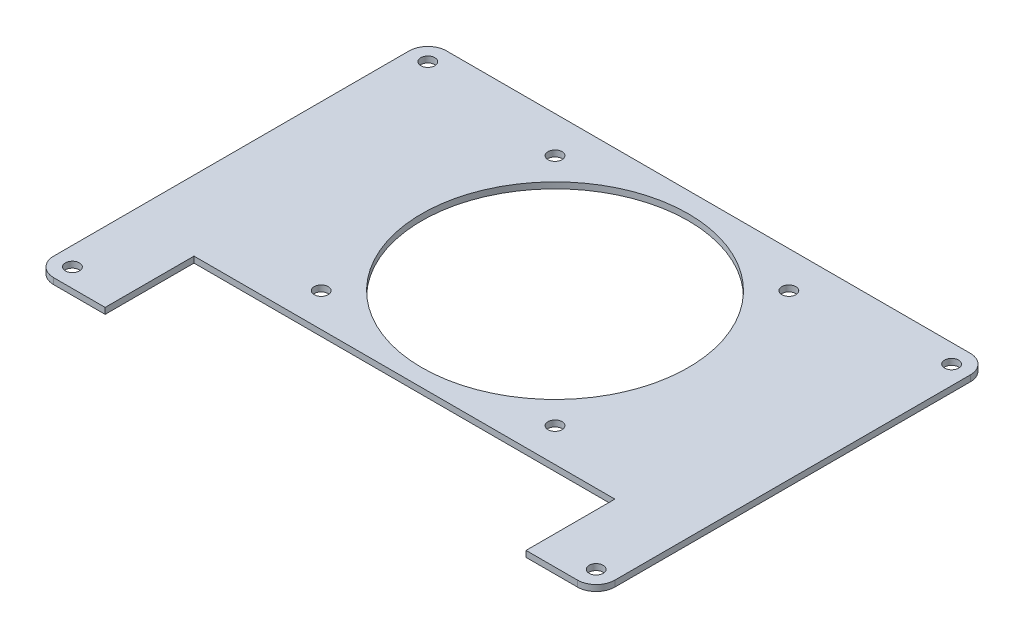
ISO-10303-21;
HEADER;
FILE_DESCRIPTION(('STEP AP214'),'2;1');
FILE_NAME('part.step','',(''),(''),'','','');
FILE_SCHEMA(('AUTOMOTIVE_DESIGN { 1 0 10303 214 1 1 1 1 }'));
ENDSEC;
DATA;
#1=APPLICATION_CONTEXT('core data for automotive mechanical design processes');
#2=APPLICATION_PROTOCOL_DEFINITION('international standard','automotive_design',2000,#1);
#3=PRODUCT_CONTEXT('',#1,'mechanical');
#4=PRODUCT('Part','Part','',(#3));
#5=PRODUCT_RELATED_PRODUCT_CATEGORY('part','',(#4));
#6=PRODUCT_DEFINITION_FORMATION('','',#4);
#7=PRODUCT_DEFINITION_CONTEXT('part definition',#1,'design');
#8=PRODUCT_DEFINITION('design','',#6,#7);
#9=PRODUCT_DEFINITION_SHAPE('','',#8);
#10=(LENGTH_UNIT() NAMED_UNIT(*) SI_UNIT(.MILLI.,.METRE.));
#11=(NAMED_UNIT(*) PLANE_ANGLE_UNIT() SI_UNIT($,.RADIAN.));
#12=(NAMED_UNIT(*) SI_UNIT($,.STERADIAN.) SOLID_ANGLE_UNIT());
#13=UNCERTAINTY_MEASURE_WITH_UNIT(LENGTH_MEASURE(1.E-05),#10,'distance_accuracy_value','');
#14=(GEOMETRIC_REPRESENTATION_CONTEXT(3) GLOBAL_UNCERTAINTY_ASSIGNED_CONTEXT((#13)) GLOBAL_UNIT_ASSIGNED_CONTEXT((#10,
#11,#12)) REPRESENTATION_CONTEXT('',''));
#15=CARTESIAN_POINT('',(0.,0.,0.));
#16=DIRECTION('',(0.,0.,1.));
#17=DIRECTION('',(1.,0.,0.));
#18=AXIS2_PLACEMENT_3D('',#15,#16,#17);
#19=CARTESIAN_POINT('',(-55.9999999999992,1.3,42.));
#20=DIRECTION('',(0.,0.,-1.));
#21=DIRECTION('',(-1.,0.,0.));
#22=AXIS2_PLACEMENT_3D('',#19,#20,#21);
#23=PLANE('',#22);
#24=DIRECTION('',(1.,0.,0.));
#25=VECTOR('',#24,1.);
#26=CARTESIAN_POINT('',(-55.9999999999992,1.3,42.));
#27=LINE('',#26,#25);
#28=CARTESIAN_POINT('',(45.,1.3,42.0000000000004));
#29=VERTEX_POINT('',#28);
#30=CARTESIAN_POINT('',(56.0000000000008,1.3,42.));
#31=VERTEX_POINT('',#30);
#32=EDGE_CURVE('E64',#29,#31,#27,.T.);
#33=ORIENTED_EDGE('',*,*,#32,.F.);
#34=DIRECTION('',(0.,-1.,0.));
#35=VECTOR('',#34,1.);
#36=CARTESIAN_POINT('',(45.,1.3,42.));
#37=LINE('',#36,#35);
#38=CARTESIAN_POINT('',(45.,0.,42.0000000000004));
#39=VERTEX_POINT('',#38);
#40=EDGE_CURVE('E47',#29,#39,#37,.T.);
#41=ORIENTED_EDGE('',*,*,#40,.T.);
#42=DIRECTION('',(1.,0.,0.));
#43=VECTOR('',#42,1.);
#44=CARTESIAN_POINT('',(-55.9999999999992,0.,42.));
#45=LINE('',#44,#43);
#46=CARTESIAN_POINT('',(56.0000000000008,0.,42.));
#47=VERTEX_POINT('',#46);
#48=EDGE_CURVE('E98',#39,#47,#45,.T.);
#49=ORIENTED_EDGE('',*,*,#48,.T.);
#50=DIRECTION('',(0.,-1.,0.));
#51=VECTOR('',#50,1.);
#52=CARTESIAN_POINT('',(56.0000000000008,1.3,42.));
#53=LINE('',#52,#51);
#54=EDGE_CURVE('E154',#31,#47,#53,.T.);
#55=ORIENTED_EDGE('',*,*,#54,.F.);
#56=EDGE_LOOP('',(#33,#41,#49,#55));
#57=FACE_BOUND('',#56,.T.);
#58=ADVANCED_FACE('F38',(#57),#23,.F.);
#59=CARTESIAN_POINT('',(56.0000000000008,1.3,38.));
#60=DIRECTION('',(0.,1.,0.));
#61=DIRECTION('',(0.,0.,1.));
#62=AXIS2_PLACEMENT_3D('',#59,#60,#61);
#63=PLANE('',#62);
#64=CARTESIAN_POINT('',(25.0000000000005,1.3,15.8));
#65=DIRECTION('',(0.,1.,0.));
#66=DIRECTION('',(0.,0.,1.));
#67=AXIS2_PLACEMENT_3D('',#64,#65,#66);
#68=CIRCLE('',#67,1.5);
#69=CARTESIAN_POINT('',(25.0000000000005,1.3,17.3));
#70=VERTEX_POINT('',#69);
#71=EDGE_CURVE('E302',#70,#70,#68,.T.);
#72=ORIENTED_EDGE('',*,*,#71,.F.);
#73=EDGE_LOOP('',(#72));
#74=FACE_BOUND('',#73,.T.);
#75=CARTESIAN_POINT('',(25.,1.3,-34.2));
#76=DIRECTION('',(0.,1.,0.));
#77=DIRECTION('',(0.,0.,1.));
#78=AXIS2_PLACEMENT_3D('',#75,#76,#77);
#79=CIRCLE('',#78,1.5);
#80=CARTESIAN_POINT('',(25.,1.3,-32.7));
#81=VERTEX_POINT('',#80);
#82=EDGE_CURVE('E300',#81,#81,#79,.T.);
#83=ORIENTED_EDGE('',*,*,#82,.F.);
#84=EDGE_LOOP('',(#83));
#85=FACE_BOUND('',#84,.T.);
#86=DIRECTION('',(0.,0.,-1.));
#87=VECTOR('',#86,1.);
#88=CARTESIAN_POINT('',(45.,1.3,23.0000000000004));
#89=LINE('',#88,#87);
#90=CARTESIAN_POINT('',(45.,1.3,23.0000000000004));
#91=VERTEX_POINT('',#90);
#92=EDGE_CURVE('E269',#29,#91,#89,.T.);
#93=ORIENTED_EDGE('',*,*,#92,.F.);
#94=ORIENTED_EDGE('',*,*,#32,.T.);
#95=CARTESIAN_POINT('',(56.0000000000008,1.3,38.));
#96=DIRECTION('',(0.,1.,0.));
#97=DIRECTION('',(0.,0.,1.));
#98=AXIS2_PLACEMENT_3D('',#95,#96,#97);
#99=CIRCLE('',#98,3.9999999999996);
#100=CARTESIAN_POINT('',(60.,1.3,38.));
#101=VERTEX_POINT('',#100);
#102=EDGE_CURVE('E173',#31,#101,#99,.T.);
#103=ORIENTED_EDGE('',*,*,#102,.T.);
#104=DIRECTION('',(0.,0.,-1.));
#105=VECTOR('',#104,1.);
#106=CARTESIAN_POINT('',(60.,1.3,38.));
#107=LINE('',#106,#105);
#108=CARTESIAN_POINT('',(60.,1.3,-38.));
#109=VERTEX_POINT('',#108);
#110=EDGE_CURVE('E107',#101,#109,#107,.T.);
#111=ORIENTED_EDGE('',*,*,#110,.T.);
#112=CARTESIAN_POINT('',(56.,1.3,-38.));
#113=DIRECTION('',(0.,1.,0.));
#114=DIRECTION('',(0.,0.,1.));
#115=AXIS2_PLACEMENT_3D('',#112,#113,#114);
#116=CIRCLE('',#115,4.);
#117=CARTESIAN_POINT('',(56.,1.3,-42.));
#118=VERTEX_POINT('',#117);
#119=EDGE_CURVE('E236',#109,#118,#116,.T.);
#120=ORIENTED_EDGE('',*,*,#119,.T.);
#121=DIRECTION('',(-1.,0.,0.));
#122=VECTOR('',#121,1.);
#123=CARTESIAN_POINT('',(-56.,1.3,-42.));
#124=LINE('',#123,#122);
#125=CARTESIAN_POINT('',(-56.,1.3,-42.));
#126=VERTEX_POINT('',#125);
#127=EDGE_CURVE('E238',#118,#126,#124,.T.);
#128=ORIENTED_EDGE('',*,*,#127,.T.);
#129=CARTESIAN_POINT('',(-56.,1.3,-38.));
#130=DIRECTION('',(0.,1.,0.));
#131=DIRECTION('',(0.,0.,1.));
#132=AXIS2_PLACEMENT_3D('',#129,#130,#131);
#133=CIRCLE('',#132,4.);
#134=CARTESIAN_POINT('',(-60.,1.3,-38.));
#135=VERTEX_POINT('',#134);
#136=EDGE_CURVE('E131',#126,#135,#133,.T.);
#137=ORIENTED_EDGE('',*,*,#136,.T.);
#138=DIRECTION('',(0.,0.,1.));
#139=VECTOR('',#138,1.);
#140=CARTESIAN_POINT('',(-60.,1.3,38.));
#141=LINE('',#140,#139);
#142=CARTESIAN_POINT('',(-60.,1.3,38.));
#143=VERTEX_POINT('',#142);
#144=EDGE_CURVE('E122',#135,#143,#141,.T.);
#145=ORIENTED_EDGE('',*,*,#144,.T.);
#146=CARTESIAN_POINT('',(-55.9999999999992,1.3,38.));
#147=DIRECTION('',(0.,1.,0.));
#148=DIRECTION('',(0.,0.,1.));
#149=AXIS2_PLACEMENT_3D('',#146,#147,#148);
#150=CIRCLE('',#149,4.0000000000004);
#151=CARTESIAN_POINT('',(-55.9999999999992,1.3,42.0000000000004));
#152=VERTEX_POINT('',#151);
#153=EDGE_CURVE('E128',#143,#152,#150,.T.);
#154=ORIENTED_EDGE('',*,*,#153,.T.);
#155=CARTESIAN_POINT('',(-45.,1.3,42.));
#156=VERTEX_POINT('',#155);
#157=EDGE_CURVE('E150',#152,#156,#27,.T.);
#158=ORIENTED_EDGE('',*,*,#157,.T.);
#159=DIRECTION('',(0.,0.,1.));
#160=VECTOR('',#159,1.);
#161=CARTESIAN_POINT('',(-45.,1.3,23.0000000000004));
#162=LINE('',#161,#160);
#163=CARTESIAN_POINT('',(-45.,1.3,23.0000000000004));
#164=VERTEX_POINT('',#163);
#165=EDGE_CURVE('E55',#164,#156,#162,.T.);
#166=ORIENTED_EDGE('',*,*,#165,.F.);
#167=DIRECTION('',(-1.,0.,0.));
#168=VECTOR('',#167,1.);
#169=CARTESIAN_POINT('',(-45.,1.3,23.0000000000004));
#170=LINE('',#169,#168);
#171=EDGE_CURVE('E261',#91,#164,#170,.T.);
#172=ORIENTED_EDGE('',*,*,#171,.F.);
#173=EDGE_LOOP('',(#93,#94,#103,#111,#120,#128,#137,#145,#154,#158,#166,#172));
#174=FACE_BOUND('',#173,.T.);
#175=CARTESIAN_POINT('',(-25.,1.3,-34.2));
#176=DIRECTION('',(0.,1.,0.));
#177=DIRECTION('',(0.,0.,1.));
#178=AXIS2_PLACEMENT_3D('',#175,#176,#177);
#179=CIRCLE('',#178,1.5);
#180=CARTESIAN_POINT('',(-25.,1.3,-32.7));
#181=VERTEX_POINT('',#180);
#182=EDGE_CURVE('E273',#181,#181,#179,.T.);
#183=ORIENTED_EDGE('',*,*,#182,.F.);
#184=EDGE_LOOP('',(#183));
#185=FACE_BOUND('',#184,.T.);
#186=CARTESIAN_POINT('',(-24.9999999999995,1.3,15.8));
#187=DIRECTION('',(0.,1.,0.));
#188=DIRECTION('',(0.,0.,1.));
#189=AXIS2_PLACEMENT_3D('',#186,#187,#188);
#190=CIRCLE('',#189,1.5);
#191=CARTESIAN_POINT('',(-24.9999999999995,1.3,17.3));
#192=VERTEX_POINT('',#191);
#193=EDGE_CURVE('E308',#192,#192,#190,.T.);
#194=ORIENTED_EDGE('',*,*,#193,.F.);
#195=EDGE_LOOP('',(#194));
#196=FACE_BOUND('',#195,.T.);
#197=CARTESIAN_POINT('',(0.,1.3,-9.19999999999999));
#198=DIRECTION('',(0.,1.,0.));
#199=DIRECTION('',(0.,0.,1.));
#200=AXIS2_PLACEMENT_3D('',#197,#198,#199);
#201=CIRCLE('',#200,28.5);
#202=CARTESIAN_POINT('',(0.,1.3,19.3));
#203=VERTEX_POINT('',#202);
#204=EDGE_CURVE('E275',#203,#203,#201,.T.);
#205=ORIENTED_EDGE('',*,*,#204,.F.);
#206=EDGE_LOOP('',(#205));
#207=FACE_BOUND('',#206,.T.);
#208=CARTESIAN_POINT('',(56.0000000000008,1.3,38.));
#209=DIRECTION('',(0.,1.,0.));
#210=DIRECTION('',(0.,0.,1.));
#211=AXIS2_PLACEMENT_3D('',#208,#209,#210);
#212=CIRCLE('',#211,1.5);
#213=CARTESIAN_POINT('',(56.0000000000008,1.3,39.5));
#214=VERTEX_POINT('',#213);
#215=EDGE_CURVE('E218',#214,#214,#212,.T.);
#216=ORIENTED_EDGE('',*,*,#215,.F.);
#217=EDGE_LOOP('',(#216));
#218=FACE_BOUND('',#217,.T.);
#219=CARTESIAN_POINT('',(-56.,1.3,-38.));
#220=DIRECTION('',(0.,1.,0.));
#221=DIRECTION('',(0.,0.,1.));
#222=AXIS2_PLACEMENT_3D('',#219,#220,#221);
#223=CIRCLE('',#222,1.5);
#224=CARTESIAN_POINT('',(-56.,1.3,-36.5));
#225=VERTEX_POINT('',#224);
#226=EDGE_CURVE('E159',#225,#225,#223,.T.);
#227=ORIENTED_EDGE('',*,*,#226,.F.);
#228=EDGE_LOOP('',(#227));
#229=FACE_BOUND('',#228,.T.);
#230=CARTESIAN_POINT('',(56.,1.3,-38.));
#231=DIRECTION('',(0.,1.,0.));
#232=DIRECTION('',(0.,0.,1.));
#233=AXIS2_PLACEMENT_3D('',#230,#231,#232);
#234=CIRCLE('',#233,1.5);
#235=CARTESIAN_POINT('',(56.,1.3,-36.5));
#236=VERTEX_POINT('',#235);
#237=EDGE_CURVE('E224',#236,#236,#234,.T.);
#238=ORIENTED_EDGE('',*,*,#237,.F.);
#239=EDGE_LOOP('',(#238));
#240=FACE_BOUND('',#239,.T.);
#241=CARTESIAN_POINT('',(-55.9999999999992,1.3,38.));
#242=DIRECTION('',(0.,1.,0.));
#243=DIRECTION('',(0.,0.,1.));
#244=AXIS2_PLACEMENT_3D('',#241,#242,#243);
#245=CIRCLE('',#244,1.5);
#246=CARTESIAN_POINT('',(-55.9999999999992,1.3,39.5));
#247=VERTEX_POINT('',#246);
#248=EDGE_CURVE('E209',#247,#247,#245,.T.);
#249=ORIENTED_EDGE('',*,*,#248,.F.);
#250=EDGE_LOOP('',(#249));
#251=FACE_BOUND('',#250,.T.);
#252=ADVANCED_FACE('F124',(#74,#85,#174,#185,#196,#207,#218,#229,#240,#251),#63,.T.);
#253=CARTESIAN_POINT('',(56.0000000000008,0.,38.));
#254=DIRECTION('',(0.,1.,0.));
#255=DIRECTION('',(0.,0.,1.));
#256=AXIS2_PLACEMENT_3D('',#253,#254,#255);
#257=PLANE('',#256);
#258=CARTESIAN_POINT('',(25.0000000000005,0.,15.8));
#259=DIRECTION('',(0.,1.,0.));
#260=DIRECTION('',(0.,0.,1.));
#261=AXIS2_PLACEMENT_3D('',#258,#259,#260);
#262=CIRCLE('',#261,1.5);
#263=CARTESIAN_POINT('',(25.0000000000005,0.,17.3));
#264=VERTEX_POINT('',#263);
#265=EDGE_CURVE('E42',#264,#264,#262,.T.);
#266=ORIENTED_EDGE('',*,*,#265,.T.);
#267=EDGE_LOOP('',(#266));
#268=FACE_BOUND('',#267,.T.);
#269=CARTESIAN_POINT('',(25.,0.,-34.2));
#270=DIRECTION('',(0.,1.,0.));
#271=DIRECTION('',(0.,0.,1.));
#272=AXIS2_PLACEMENT_3D('',#269,#270,#271);
#273=CIRCLE('',#272,1.5);
#274=CARTESIAN_POINT('',(25.,0.,-32.7));
#275=VERTEX_POINT('',#274);
#276=EDGE_CURVE('E200',#275,#275,#273,.T.);
#277=ORIENTED_EDGE('',*,*,#276,.T.);
#278=EDGE_LOOP('',(#277));
#279=FACE_BOUND('',#278,.T.);
#280=ORIENTED_EDGE('',*,*,#48,.F.);
#281=DIRECTION('',(0.,0.,-1.));
#282=VECTOR('',#281,1.);
#283=CARTESIAN_POINT('',(45.,0.,38.));
#284=LINE('',#283,#282);
#285=CARTESIAN_POINT('',(45.,0.,23.0000000000004));
#286=VERTEX_POINT('',#285);
#287=EDGE_CURVE('E195',#39,#286,#284,.T.);
#288=ORIENTED_EDGE('',*,*,#287,.T.);
#289=DIRECTION('',(-1.,0.,0.));
#290=VECTOR('',#289,1.);
#291=CARTESIAN_POINT('',(56.0000000000008,0.,23.0000000000004));
#292=LINE('',#291,#290);
#293=CARTESIAN_POINT('',(-45.,0.,23.0000000000004));
#294=VERTEX_POINT('',#293);
#295=EDGE_CURVE('E11',#286,#294,#292,.T.);
#296=ORIENTED_EDGE('',*,*,#295,.T.);
#297=DIRECTION('',(0.,0.,1.));
#298=VECTOR('',#297,1.);
#299=CARTESIAN_POINT('',(-45.,0.,38.));
#300=LINE('',#299,#298);
#301=CARTESIAN_POINT('',(-45.,0.,42.0000000000004));
#302=VERTEX_POINT('',#301);
#303=EDGE_CURVE('E278',#294,#302,#300,.T.);
#304=ORIENTED_EDGE('',*,*,#303,.T.);
#305=CARTESIAN_POINT('',(-55.9999999999992,0.,42.0000000000004));
#306=VERTEX_POINT('',#305);
#307=EDGE_CURVE('E170',#306,#302,#45,.T.);
#308=ORIENTED_EDGE('',*,*,#307,.F.);
#309=CARTESIAN_POINT('',(-55.9999999999992,0.,38.));
#310=DIRECTION('',(0.,1.,0.));
#311=DIRECTION('',(0.,0.,1.));
#312=AXIS2_PLACEMENT_3D('',#309,#310,#311);
#313=CIRCLE('',#312,4.0000000000004);
#314=CARTESIAN_POINT('',(-60.,0.,38.));
#315=VERTEX_POINT('',#314);
#316=EDGE_CURVE('E168',#315,#306,#313,.T.);
#317=ORIENTED_EDGE('',*,*,#316,.F.);
#318=DIRECTION('',(0.,0.,1.));
#319=VECTOR('',#318,1.);
#320=CARTESIAN_POINT('',(-60.,0.,38.));
#321=LINE('',#320,#319);
#322=CARTESIAN_POINT('',(-60.,0.,-38.));
#323=VERTEX_POINT('',#322);
#324=EDGE_CURVE('E140',#323,#315,#321,.T.);
#325=ORIENTED_EDGE('',*,*,#324,.F.);
#326=CARTESIAN_POINT('',(-56.,0.,-38.));
#327=DIRECTION('',(0.,1.,0.));
#328=DIRECTION('',(0.,0.,1.));
#329=AXIS2_PLACEMENT_3D('',#326,#327,#328);
#330=CIRCLE('',#329,4.);
#331=CARTESIAN_POINT('',(-56.,0.,-42.));
#332=VERTEX_POINT('',#331);
#333=EDGE_CURVE('E165',#332,#323,#330,.T.);
#334=ORIENTED_EDGE('',*,*,#333,.F.);
#335=DIRECTION('',(-1.,0.,0.));
#336=VECTOR('',#335,1.);
#337=CARTESIAN_POINT('',(-56.,0.,-42.));
#338=LINE('',#337,#336);
#339=CARTESIAN_POINT('',(56.,0.,-42.));
#340=VERTEX_POINT('',#339);
#341=EDGE_CURVE('E163',#340,#332,#338,.T.);
#342=ORIENTED_EDGE('',*,*,#341,.F.);
#343=CARTESIAN_POINT('',(56.,0.,-38.));
#344=DIRECTION('',(0.,1.,0.));
#345=DIRECTION('',(0.,0.,1.));
#346=AXIS2_PLACEMENT_3D('',#343,#344,#345);
#347=CIRCLE('',#346,4.);
#348=CARTESIAN_POINT('',(60.,0.,-38.));
#349=VERTEX_POINT('',#348);
#350=EDGE_CURVE('E161',#349,#340,#347,.T.);
#351=ORIENTED_EDGE('',*,*,#350,.F.);
#352=DIRECTION('',(0.,0.,-1.));
#353=VECTOR('',#352,1.);
#354=CARTESIAN_POINT('',(60.,0.,38.));
#355=LINE('',#354,#353);
#356=CARTESIAN_POINT('',(60.,0.,38.));
#357=VERTEX_POINT('',#356);
#358=EDGE_CURVE('E158',#357,#349,#355,.T.);
#359=ORIENTED_EDGE('',*,*,#358,.F.);
#360=CARTESIAN_POINT('',(56.0000000000008,0.,38.));
#361=DIRECTION('',(0.,1.,0.));
#362=DIRECTION('',(0.,0.,1.));
#363=AXIS2_PLACEMENT_3D('',#360,#361,#362);
#364=CIRCLE('',#363,3.9999999999996);
#365=EDGE_CURVE('E155',#47,#357,#364,.T.);
#366=ORIENTED_EDGE('',*,*,#365,.F.);
#367=EDGE_LOOP('',(#280,#288,#296,#304,#308,#317,#325,#334,#342,#351,#359,#366));
#368=FACE_BOUND('',#367,.T.);
#369=CARTESIAN_POINT('',(-25.,0.,-34.2));
#370=DIRECTION('',(0.,1.,0.));
#371=DIRECTION('',(0.,0.,1.));
#372=AXIS2_PLACEMENT_3D('',#369,#370,#371);
#373=CIRCLE('',#372,1.5);
#374=CARTESIAN_POINT('',(-25.,0.,-32.7));
#375=VERTEX_POINT('',#374);
#376=EDGE_CURVE('E198',#375,#375,#373,.T.);
#377=ORIENTED_EDGE('',*,*,#376,.T.);
#378=EDGE_LOOP('',(#377));
#379=FACE_BOUND('',#378,.T.);
#380=CARTESIAN_POINT('',(-24.9999999999995,0.,15.8));
#381=DIRECTION('',(0.,1.,0.));
#382=DIRECTION('',(0.,0.,1.));
#383=AXIS2_PLACEMENT_3D('',#380,#381,#382);
#384=CIRCLE('',#383,1.5);
#385=CARTESIAN_POINT('',(-24.9999999999995,0.,17.3));
#386=VERTEX_POINT('',#385);
#387=EDGE_CURVE('E194',#386,#386,#384,.T.);
#388=ORIENTED_EDGE('',*,*,#387,.T.);
#389=EDGE_LOOP('',(#388));
#390=FACE_BOUND('',#389,.T.);
#391=CARTESIAN_POINT('',(0.,0.,-9.19999999999999));
#392=DIRECTION('',(0.,1.,0.));
#393=DIRECTION('',(0.,0.,1.));
#394=AXIS2_PLACEMENT_3D('',#391,#392,#393);
#395=CIRCLE('',#394,28.5);
#396=CARTESIAN_POINT('',(0.,0.,19.3));
#397=VERTEX_POINT('',#396);
#398=EDGE_CURVE('E191',#397,#397,#395,.T.);
#399=ORIENTED_EDGE('',*,*,#398,.T.);
#400=EDGE_LOOP('',(#399));
#401=FACE_BOUND('',#400,.T.);
#402=CARTESIAN_POINT('',(-56.,0.,-38.));
#403=DIRECTION('',(0.,1.,0.));
#404=DIRECTION('',(0.,0.,1.));
#405=AXIS2_PLACEMENT_3D('',#402,#403,#404);
#406=CIRCLE('',#405,1.5);
#407=CARTESIAN_POINT('',(-56.,0.,-36.5));
#408=VERTEX_POINT('',#407);
#409=EDGE_CURVE('E227',#408,#408,#406,.T.);
#410=ORIENTED_EDGE('',*,*,#409,.T.);
#411=EDGE_LOOP('',(#410));
#412=FACE_BOUND('',#411,.T.);
#413=CARTESIAN_POINT('',(56.,0.,-38.));
#414=DIRECTION('',(0.,1.,0.));
#415=DIRECTION('',(0.,0.,1.));
#416=AXIS2_PLACEMENT_3D('',#413,#414,#415);
#417=CIRCLE('',#416,1.5);
#418=CARTESIAN_POINT('',(56.,0.,-36.5));
#419=VERTEX_POINT('',#418);
#420=EDGE_CURVE('E221',#419,#419,#417,.T.);
#421=ORIENTED_EDGE('',*,*,#420,.T.);
#422=EDGE_LOOP('',(#421));
#423=FACE_BOUND('',#422,.T.);
#424=CARTESIAN_POINT('',(56.0000000000008,0.,38.));
#425=DIRECTION('',(0.,1.,0.));
#426=DIRECTION('',(0.,0.,1.));
#427=AXIS2_PLACEMENT_3D('',#424,#425,#426);
#428=CIRCLE('',#427,1.5);
#429=CARTESIAN_POINT('',(56.0000000000008,0.,39.5));
#430=VERTEX_POINT('',#429);
#431=EDGE_CURVE('E214',#430,#430,#428,.T.);
#432=ORIENTED_EDGE('',*,*,#431,.T.);
#433=EDGE_LOOP('',(#432));
#434=FACE_BOUND('',#433,.T.);
#435=CARTESIAN_POINT('',(-55.9999999999992,0.,38.));
#436=DIRECTION('',(0.,1.,0.));
#437=DIRECTION('',(0.,0.,1.));
#438=AXIS2_PLACEMENT_3D('',#435,#436,#437);
#439=CIRCLE('',#438,1.5);
#440=CARTESIAN_POINT('',(-55.9999999999992,0.,39.5));
#441=VERTEX_POINT('',#440);
#442=EDGE_CURVE('E205',#441,#441,#439,.T.);
#443=ORIENTED_EDGE('',*,*,#442,.T.);
#444=EDGE_LOOP('',(#443));
#445=FACE_BOUND('',#444,.T.);
#446=ADVANCED_FACE('F250',(#268,#279,#368,#379,#390,#401,#412,#423,#434,#445),#257,.F.);
#447=CARTESIAN_POINT('',(56.0000000000008,1.3,38.));
#448=DIRECTION('',(0.,-1.,0.));
#449=DIRECTION('',(0.,0.,-1.));
#450=AXIS2_PLACEMENT_3D('',#447,#448,#449);
#451=CYLINDRICAL_SURFACE('',#450,3.9999999999996);
#452=ORIENTED_EDGE('',*,*,#365,.T.);
#453=DIRECTION('',(0.,-1.,0.));
#454=VECTOR('',#453,1.);
#455=CARTESIAN_POINT('',(60.,1.3,38.));
#456=LINE('',#455,#454);
#457=EDGE_CURVE('E186',#101,#357,#456,.T.);
#458=ORIENTED_EDGE('',*,*,#457,.F.);
#459=ORIENTED_EDGE('',*,*,#102,.F.);
#460=ORIENTED_EDGE('',*,*,#54,.T.);
#461=EDGE_LOOP('',(#452,#458,#459,#460));
#462=FACE_BOUND('',#461,.T.);
#463=ADVANCED_FACE('F40',(#462),#451,.T.);
#464=CARTESIAN_POINT('',(60.,1.3,38.));
#465=DIRECTION('',(-1.,0.,0.));
#466=DIRECTION('',(0.,0.,1.));
#467=AXIS2_PLACEMENT_3D('',#464,#465,#466);
#468=PLANE('',#467);
#469=ORIENTED_EDGE('',*,*,#358,.T.);
#470=DIRECTION('',(0.,-1.,0.));
#471=VECTOR('',#470,1.);
#472=CARTESIAN_POINT('',(60.,1.3,-38.));
#473=LINE('',#472,#471);
#474=EDGE_CURVE('E183',#109,#349,#473,.T.);
#475=ORIENTED_EDGE('',*,*,#474,.F.);
#476=ORIENTED_EDGE('',*,*,#110,.F.);
#477=ORIENTED_EDGE('',*,*,#457,.T.);
#478=EDGE_LOOP('',(#469,#475,#476,#477));
#479=FACE_BOUND('',#478,.T.);
#480=ADVANCED_FACE('F372',(#479),#468,.F.);
#481=CARTESIAN_POINT('',(56.,1.3,-38.));
#482=DIRECTION('',(0.,-1.,0.));
#483=DIRECTION('',(0.,0.,-1.));
#484=AXIS2_PLACEMENT_3D('',#481,#482,#483);
#485=CYLINDRICAL_SURFACE('',#484,4.);
#486=ORIENTED_EDGE('',*,*,#350,.T.);
#487=DIRECTION('',(0.,-1.,0.));
#488=VECTOR('',#487,1.);
#489=CARTESIAN_POINT('',(56.,1.3,-42.));
#490=LINE('',#489,#488);
#491=EDGE_CURVE('E180',#118,#340,#490,.T.);
#492=ORIENTED_EDGE('',*,*,#491,.F.);
#493=ORIENTED_EDGE('',*,*,#119,.F.);
#494=ORIENTED_EDGE('',*,*,#474,.T.);
#495=EDGE_LOOP('',(#486,#492,#493,#494));
#496=FACE_BOUND('',#495,.T.);
#497=ADVANCED_FACE('F370',(#496),#485,.T.);
#498=CARTESIAN_POINT('',(-56.,1.3,-42.));
#499=DIRECTION('',(0.,0.,1.));
#500=DIRECTION('',(1.,0.,0.));
#501=AXIS2_PLACEMENT_3D('',#498,#499,#500);
#502=PLANE('',#501);
#503=ORIENTED_EDGE('',*,*,#341,.T.);
#504=DIRECTION('',(0.,-1.,0.));
#505=VECTOR('',#504,1.);
#506=CARTESIAN_POINT('',(-56.,1.3,-42.));
#507=LINE('',#506,#505);
#508=EDGE_CURVE('E177',#126,#332,#507,.T.);
#509=ORIENTED_EDGE('',*,*,#508,.F.);
#510=ORIENTED_EDGE('',*,*,#127,.F.);
#511=ORIENTED_EDGE('',*,*,#491,.T.);
#512=EDGE_LOOP('',(#503,#509,#510,#511));
#513=FACE_BOUND('',#512,.T.);
#514=ADVANCED_FACE('F244',(#513),#502,.F.);
#515=CARTESIAN_POINT('',(-56.,1.3,-38.));
#516=DIRECTION('',(0.,-1.,0.));
#517=DIRECTION('',(0.,0.,-1.));
#518=AXIS2_PLACEMENT_3D('',#515,#516,#517);
#519=CYLINDRICAL_SURFACE('',#518,4.);
#520=ORIENTED_EDGE('',*,*,#333,.T.);
#521=DIRECTION('',(0.,-1.,0.));
#522=VECTOR('',#521,1.);
#523=CARTESIAN_POINT('',(-60.,1.3,-38.));
#524=LINE('',#523,#522);
#525=EDGE_CURVE('E143',#135,#323,#524,.T.);
#526=ORIENTED_EDGE('',*,*,#525,.F.);
#527=ORIENTED_EDGE('',*,*,#136,.F.);
#528=ORIENTED_EDGE('',*,*,#508,.T.);
#529=EDGE_LOOP('',(#520,#526,#527,#528));
#530=FACE_BOUND('',#529,.T.);
#531=ADVANCED_FACE('F248',(#530),#519,.T.);
#532=CARTESIAN_POINT('',(-60.,1.3,38.));
#533=DIRECTION('',(1.,0.,0.));
#534=DIRECTION('',(0.,0.,-1.));
#535=AXIS2_PLACEMENT_3D('',#532,#533,#534);
#536=PLANE('',#535);
#537=ORIENTED_EDGE('',*,*,#324,.T.);
#538=DIRECTION('',(0.,-1.,0.));
#539=VECTOR('',#538,1.);
#540=CARTESIAN_POINT('',(-60.,1.3,38.));
#541=LINE('',#540,#539);
#542=EDGE_CURVE('E137',#143,#315,#541,.T.);
#543=ORIENTED_EDGE('',*,*,#542,.F.);
#544=ORIENTED_EDGE('',*,*,#144,.F.);
#545=ORIENTED_EDGE('',*,*,#525,.T.);
#546=EDGE_LOOP('',(#537,#543,#544,#545));
#547=FACE_BOUND('',#546,.T.);
#548=ADVANCED_FACE('F138',(#547),#536,.F.);
#549=CARTESIAN_POINT('',(-55.9999999999992,1.3,38.));
#550=DIRECTION('',(0.,-1.,0.));
#551=DIRECTION('',(0.,0.,-1.));
#552=AXIS2_PLACEMENT_3D('',#549,#550,#551);
#553=CYLINDRICAL_SURFACE('',#552,4.0000000000004);
#554=ORIENTED_EDGE('',*,*,#316,.T.);
#555=DIRECTION('',(0.,-1.,0.));
#556=VECTOR('',#555,1.);
#557=CARTESIAN_POINT('',(-55.9999999999992,1.3,42.0000000000004));
#558=LINE('',#557,#556);
#559=EDGE_CURVE('E144',#152,#306,#558,.T.);
#560=ORIENTED_EDGE('',*,*,#559,.F.);
#561=ORIENTED_EDGE('',*,*,#153,.F.);
#562=ORIENTED_EDGE('',*,*,#542,.T.);
#563=EDGE_LOOP('',(#554,#560,#561,#562));
#564=FACE_BOUND('',#563,.T.);
#565=ADVANCED_FACE('F146',(#564),#553,.T.);
#566=ORIENTED_EDGE('',*,*,#307,.T.);
#567=DIRECTION('',(0.,1.,0.));
#568=VECTOR('',#567,1.);
#569=CARTESIAN_POINT('',(-45.,1.3,42.));
#570=LINE('',#569,#568);
#571=EDGE_CURVE('E188',#302,#156,#570,.T.);
#572=ORIENTED_EDGE('',*,*,#571,.T.);
#573=ORIENTED_EDGE('',*,*,#157,.F.);
#574=ORIENTED_EDGE('',*,*,#559,.T.);
#575=EDGE_LOOP('',(#566,#572,#573,#574));
#576=FACE_BOUND('',#575,.T.);
#577=ADVANCED_FACE('F255',(#576),#23,.F.);
#578=CARTESIAN_POINT('',(-56.,1.3,-38.));
#579=DIRECTION('',(0.,-1.,0.));
#580=DIRECTION('',(0.,0.,-1.));
#581=AXIS2_PLACEMENT_3D('',#578,#579,#580);
#582=CYLINDRICAL_SURFACE('',#581,1.5);
#583=ORIENTED_EDGE('',*,*,#226,.T.);
#584=EDGE_LOOP('',(#583));
#585=FACE_BOUND('',#584,.T.);
#586=ORIENTED_EDGE('',*,*,#409,.F.);
#587=EDGE_LOOP('',(#586));
#588=FACE_BOUND('',#587,.T.);
#589=ADVANCED_FACE('F352',(#585,#588),#582,.F.);
#590=CARTESIAN_POINT('',(56.,1.3,-38.));
#591=DIRECTION('',(0.,-1.,0.));
#592=DIRECTION('',(0.,0.,-1.));
#593=AXIS2_PLACEMENT_3D('',#590,#591,#592);
#594=CYLINDRICAL_SURFACE('',#593,1.5);
#595=ORIENTED_EDGE('',*,*,#237,.T.);
#596=EDGE_LOOP('',(#595));
#597=FACE_BOUND('',#596,.T.);
#598=ORIENTED_EDGE('',*,*,#420,.F.);
#599=EDGE_LOOP('',(#598));
#600=FACE_BOUND('',#599,.T.);
#601=ADVANCED_FACE('F341',(#597,#600),#594,.F.);
#602=CARTESIAN_POINT('',(56.0000000000008,1.3,38.));
#603=DIRECTION('',(0.,-1.,0.));
#604=DIRECTION('',(0.,0.,-1.));
#605=AXIS2_PLACEMENT_3D('',#602,#603,#604);
#606=CYLINDRICAL_SURFACE('',#605,1.5);
#607=ORIENTED_EDGE('',*,*,#215,.T.);
#608=EDGE_LOOP('',(#607));
#609=FACE_BOUND('',#608,.T.);
#610=ORIENTED_EDGE('',*,*,#431,.F.);
#611=EDGE_LOOP('',(#610));
#612=FACE_BOUND('',#611,.T.);
#613=ADVANCED_FACE('F333',(#609,#612),#606,.F.);
#614=CARTESIAN_POINT('',(-55.9999999999992,1.3,38.));
#615=DIRECTION('',(0.,-1.,0.));
#616=DIRECTION('',(0.,0.,-1.));
#617=AXIS2_PLACEMENT_3D('',#614,#615,#616);
#618=CYLINDRICAL_SURFACE('',#617,1.5);
#619=ORIENTED_EDGE('',*,*,#248,.T.);
#620=EDGE_LOOP('',(#619));
#621=FACE_BOUND('',#620,.T.);
#622=ORIENTED_EDGE('',*,*,#442,.F.);
#623=EDGE_LOOP('',(#622));
#624=FACE_BOUND('',#623,.T.);
#625=ADVANCED_FACE('F330',(#621,#624),#618,.F.);
#626=CARTESIAN_POINT('',(-45.,-8.7,23.0000000000004));
#627=DIRECTION('',(0.,0.,-1.));
#628=DIRECTION('',(-1.,0.,0.));
#629=AXIS2_PLACEMENT_3D('',#626,#627,#628);
#630=PLANE('',#629);
#631=DIRECTION('',(0.,1.,0.));
#632=VECTOR('',#631,1.);
#633=CARTESIAN_POINT('',(45.,-8.7,23.0000000000004));
#634=LINE('',#633,#632);
#635=EDGE_CURVE('E264',#286,#91,#634,.T.);
#636=ORIENTED_EDGE('',*,*,#635,.T.);
#637=ORIENTED_EDGE('',*,*,#171,.T.);
#638=DIRECTION('',(0.,1.,0.));
#639=VECTOR('',#638,1.);
#640=CARTESIAN_POINT('',(-45.,-8.7,23.0000000000004));
#641=LINE('',#640,#639);
#642=EDGE_CURVE('E267',#294,#164,#641,.T.);
#643=ORIENTED_EDGE('',*,*,#642,.F.);
#644=ORIENTED_EDGE('',*,*,#295,.F.);
#645=EDGE_LOOP('',(#636,#637,#643,#644));
#646=FACE_BOUND('',#645,.T.);
#647=ADVANCED_FACE('F299',(#646),#630,.F.);
#648=CARTESIAN_POINT('',(45.,-8.7,23.0000000000004));
#649=DIRECTION('',(1.,0.,0.));
#650=DIRECTION('',(0.,0.,-1.));
#651=AXIS2_PLACEMENT_3D('',#648,#649,#650);
#652=PLANE('',#651);
#653=ORIENTED_EDGE('',*,*,#40,.F.);
#654=ORIENTED_EDGE('',*,*,#92,.T.);
#655=ORIENTED_EDGE('',*,*,#635,.F.);
#656=ORIENTED_EDGE('',*,*,#287,.F.);
#657=EDGE_LOOP('',(#653,#654,#655,#656));
#658=FACE_BOUND('',#657,.T.);
#659=ADVANCED_FACE('F288',(#658),#652,.F.);
#660=CARTESIAN_POINT('',(-45.,-8.7,23.0000000000004));
#661=DIRECTION('',(-1.,0.,0.));
#662=DIRECTION('',(0.,0.,1.));
#663=AXIS2_PLACEMENT_3D('',#660,#661,#662);
#664=PLANE('',#663);
#665=ORIENTED_EDGE('',*,*,#642,.T.);
#666=ORIENTED_EDGE('',*,*,#165,.T.);
#667=ORIENTED_EDGE('',*,*,#571,.F.);
#668=ORIENTED_EDGE('',*,*,#303,.F.);
#669=EDGE_LOOP('',(#665,#666,#667,#668));
#670=FACE_BOUND('',#669,.T.);
#671=ADVANCED_FACE('F296',(#670),#664,.F.);
#672=CARTESIAN_POINT('',(0.,-8.7,-9.19999999999999));
#673=DIRECTION('',(0.,1.,0.));
#674=DIRECTION('',(0.,0.,1.));
#675=AXIS2_PLACEMENT_3D('',#672,#673,#674);
#676=CYLINDRICAL_SURFACE('',#675,28.5);
#677=ORIENTED_EDGE('',*,*,#204,.T.);
#678=EDGE_LOOP('',(#677));
#679=FACE_BOUND('',#678,.T.);
#680=ORIENTED_EDGE('',*,*,#398,.F.);
#681=EDGE_LOOP('',(#680));
#682=FACE_BOUND('',#681,.T.);
#683=ADVANCED_FACE('F430',(#679,#682),#676,.F.);
#684=CARTESIAN_POINT('',(-24.9999999999995,-8.7,15.8));
#685=DIRECTION('',(0.,1.,0.));
#686=DIRECTION('',(0.,0.,1.));
#687=AXIS2_PLACEMENT_3D('',#684,#685,#686);
#688=CYLINDRICAL_SURFACE('',#687,1.5);
#689=ORIENTED_EDGE('',*,*,#193,.T.);
#690=EDGE_LOOP('',(#689));
#691=FACE_BOUND('',#690,.T.);
#692=ORIENTED_EDGE('',*,*,#387,.F.);
#693=EDGE_LOOP('',(#692));
#694=FACE_BOUND('',#693,.T.);
#695=ADVANCED_FACE('F313',(#691,#694),#688,.F.);
#696=CARTESIAN_POINT('',(-25.,-8.7,-34.2));
#697=DIRECTION('',(0.,1.,0.));
#698=DIRECTION('',(0.,0.,1.));
#699=AXIS2_PLACEMENT_3D('',#696,#697,#698);
#700=CYLINDRICAL_SURFACE('',#699,1.5);
#701=ORIENTED_EDGE('',*,*,#182,.T.);
#702=EDGE_LOOP('',(#701));
#703=FACE_BOUND('',#702,.T.);
#704=ORIENTED_EDGE('',*,*,#376,.F.);
#705=EDGE_LOOP('',(#704));
#706=FACE_BOUND('',#705,.T.);
#707=ADVANCED_FACE('F445',(#703,#706),#700,.F.);
#708=CARTESIAN_POINT('',(25.,-8.7,-34.2));
#709=DIRECTION('',(0.,1.,0.));
#710=DIRECTION('',(0.,0.,1.));
#711=AXIS2_PLACEMENT_3D('',#708,#709,#710);
#712=CYLINDRICAL_SURFACE('',#711,1.5);
#713=ORIENTED_EDGE('',*,*,#82,.T.);
#714=EDGE_LOOP('',(#713));
#715=FACE_BOUND('',#714,.T.);
#716=ORIENTED_EDGE('',*,*,#276,.F.);
#717=EDGE_LOOP('',(#716));
#718=FACE_BOUND('',#717,.T.);
#719=ADVANCED_FACE('F453',(#715,#718),#712,.F.);
#720=CARTESIAN_POINT('',(25.0000000000005,-8.7,15.8));
#721=DIRECTION('',(0.,1.,0.));
#722=DIRECTION('',(0.,0.,1.));
#723=AXIS2_PLACEMENT_3D('',#720,#721,#722);
#724=CYLINDRICAL_SURFACE('',#723,1.5);
#725=ORIENTED_EDGE('',*,*,#71,.T.);
#726=EDGE_LOOP('',(#725));
#727=FACE_BOUND('',#726,.T.);
#728=ORIENTED_EDGE('',*,*,#265,.F.);
#729=EDGE_LOOP('',(#728));
#730=FACE_BOUND('',#729,.T.);
#731=ADVANCED_FACE('F462',(#727,#730),#724,.F.);
#732=CLOSED_SHELL('',(#58,#252,#446,#463,#480,#497,#514,#531,#548,#565,#577,#589,#601,#613,#625,
#647,#659,#671,#683,#695,#707,#719,#731));
#733=MANIFOLD_SOLID_BREP('B2',#732);
#734=ADVANCED_BREP_SHAPE_REPRESENTATION('',(#18,#733),#14);
#735=SHAPE_DEFINITION_REPRESENTATION(#9,#734);
ENDSEC;
END-ISO-10303-21;
